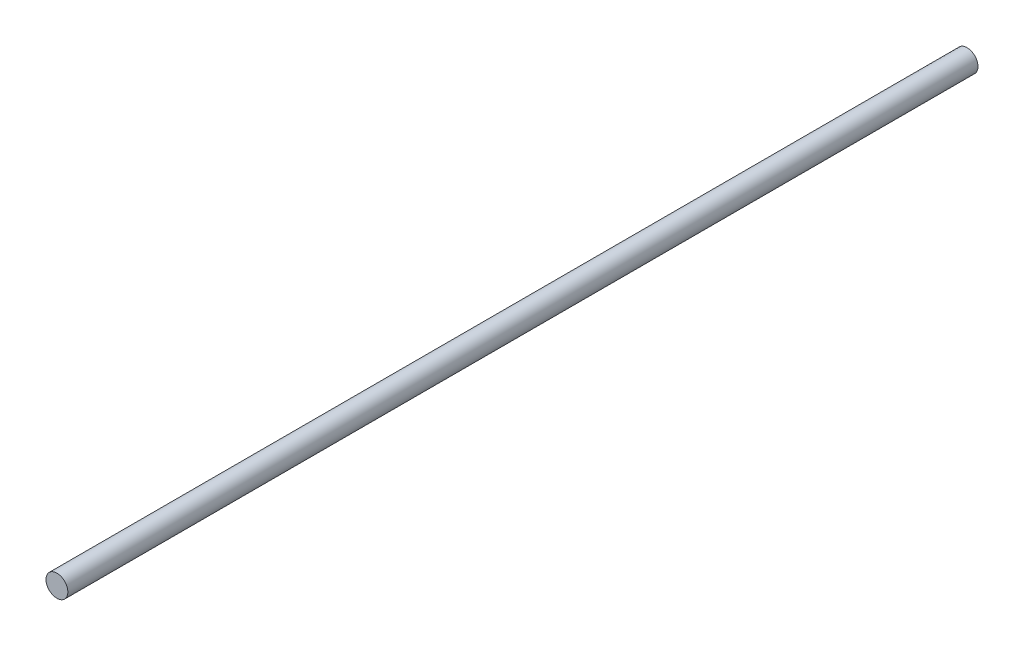
ISO-10303-21;
HEADER;
FILE_DESCRIPTION(('STEP AP214'),'2;1');
FILE_NAME('part.step','',(''),(''),'','','');
FILE_SCHEMA(('AUTOMOTIVE_DESIGN { 1 0 10303 214 1 1 1 1 }'));
ENDSEC;
DATA;
#1=APPLICATION_CONTEXT('core data for automotive mechanical design processes');
#2=APPLICATION_PROTOCOL_DEFINITION('international standard','automotive_design',2000,#1);
#3=PRODUCT_CONTEXT('',#1,'mechanical');
#4=PRODUCT('Part','Part','',(#3));
#5=PRODUCT_RELATED_PRODUCT_CATEGORY('part','',(#4));
#6=PRODUCT_DEFINITION_FORMATION('','',#4);
#7=PRODUCT_DEFINITION_CONTEXT('part definition',#1,'design');
#8=PRODUCT_DEFINITION('design','',#6,#7);
#9=PRODUCT_DEFINITION_SHAPE('','',#8);
#10=(LENGTH_UNIT() NAMED_UNIT(*) SI_UNIT(.MILLI.,.METRE.));
#11=(NAMED_UNIT(*) PLANE_ANGLE_UNIT() SI_UNIT($,.RADIAN.));
#12=(NAMED_UNIT(*) SI_UNIT($,.STERADIAN.) SOLID_ANGLE_UNIT());
#13=UNCERTAINTY_MEASURE_WITH_UNIT(LENGTH_MEASURE(1.E-05),#10,'distance_accuracy_value','');
#14=(GEOMETRIC_REPRESENTATION_CONTEXT(3) GLOBAL_UNCERTAINTY_ASSIGNED_CONTEXT((#13)) GLOBAL_UNIT_ASSIGNED_CONTEXT((#10,
#11,#12)) REPRESENTATION_CONTEXT('',''));
#15=CARTESIAN_POINT('',(0.,0.,0.));
#16=DIRECTION('',(0.,0.,1.));
#17=DIRECTION('',(1.,0.,0.));
#18=AXIS2_PLACEMENT_3D('',#15,#16,#17);
#19=CARTESIAN_POINT('',(0.,0.,250.));
#20=DIRECTION('',(0.,0.,-1.));
#21=DIRECTION('',(-1.,0.,0.));
#22=AXIS2_PLACEMENT_3D('',#19,#20,#21);
#23=CYLINDRICAL_SURFACE('',#22,3.);
#24=CARTESIAN_POINT('',(0.,0.,250.));
#25=DIRECTION('',(0.,0.,1.));
#26=DIRECTION('',(1.,0.,0.));
#27=AXIS2_PLACEMENT_3D('',#24,#25,#26);
#28=CIRCLE('',#27,3.);
#29=CARTESIAN_POINT('',(3.,0.,250.));
#30=VERTEX_POINT('',#29);
#31=EDGE_CURVE('E10',#30,#30,#28,.T.);
#32=ORIENTED_EDGE('',*,*,#31,.F.);
#33=EDGE_LOOP('',(#32));
#34=FACE_BOUND('',#33,.T.);
#35=CARTESIAN_POINT('',(0.,0.,0.));
#36=DIRECTION('',(0.,0.,1.));
#37=DIRECTION('',(1.,0.,0.));
#38=AXIS2_PLACEMENT_3D('',#35,#36,#37);
#39=CIRCLE('',#38,3.);
#40=CARTESIAN_POINT('',(3.,0.,0.));
#41=VERTEX_POINT('',#40);
#42=EDGE_CURVE('E33',#41,#41,#39,.T.);
#43=ORIENTED_EDGE('',*,*,#42,.T.);
#44=EDGE_LOOP('',(#43));
#45=FACE_BOUND('',#44,.T.);
#46=ADVANCED_FACE('F30',(#34,#45),#23,.T.);
#47=CARTESIAN_POINT('',(0.,0.,250.));
#48=DIRECTION('',(0.,0.,1.));
#49=DIRECTION('',(1.,0.,0.));
#50=AXIS2_PLACEMENT_3D('',#47,#48,#49);
#51=PLANE('',#50);
#52=ORIENTED_EDGE('',*,*,#31,.T.);
#53=EDGE_LOOP('',(#52));
#54=FACE_BOUND('',#53,.T.);
#55=ADVANCED_FACE('F45',(#54),#51,.T.);
#56=CARTESIAN_POINT('',(0.,0.,0.));
#57=DIRECTION('',(0.,0.,1.));
#58=DIRECTION('',(1.,0.,0.));
#59=AXIS2_PLACEMENT_3D('',#56,#57,#58);
#60=PLANE('',#59);
#61=ORIENTED_EDGE('',*,*,#42,.F.);
#62=EDGE_LOOP('',(#61));
#63=FACE_BOUND('',#62,.T.);
#64=ADVANCED_FACE('F43',(#63),#60,.F.);
#65=CLOSED_SHELL('',(#46,#55,#64));
#66=MANIFOLD_SOLID_BREP('B2',#65);
#67=ADVANCED_BREP_SHAPE_REPRESENTATION('',(#18,#66),#14);
#68=SHAPE_DEFINITION_REPRESENTATION(#9,#67);
ENDSEC;
END-ISO-10303-21;
